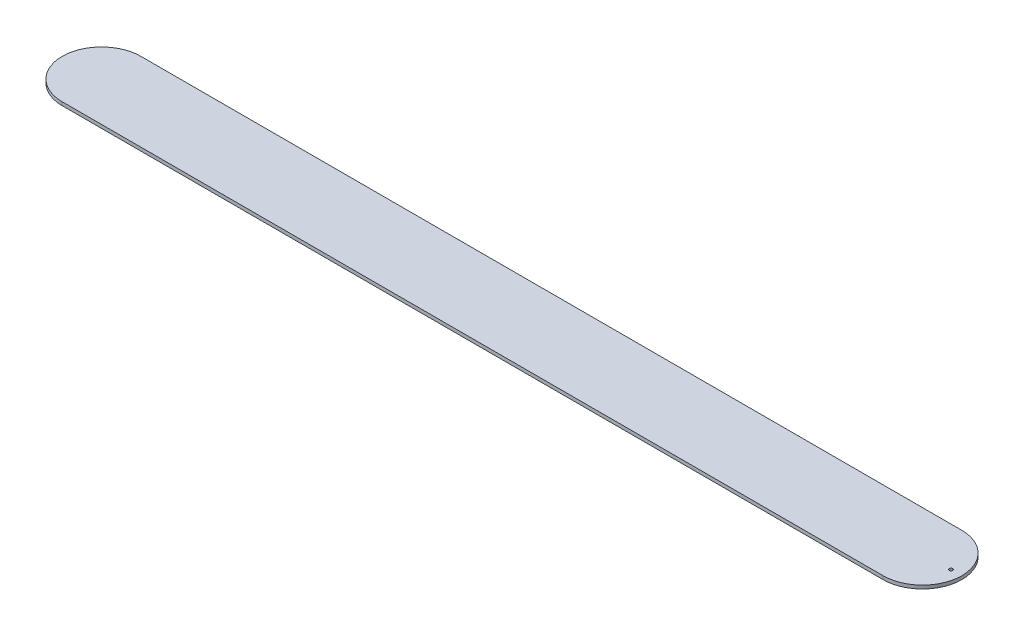
ISO-10303-21;
HEADER;
FILE_DESCRIPTION(('STEP AP214'),'2;1');
FILE_NAME('part.step','',(''),(''),'','','');
FILE_SCHEMA(('AUTOMOTIVE_DESIGN { 1 0 10303 214 1 1 1 1 }'));
ENDSEC;
DATA;
#1=APPLICATION_CONTEXT('core data for automotive mechanical design processes');
#2=APPLICATION_PROTOCOL_DEFINITION('international standard','automotive_design',2000,#1);
#3=PRODUCT_CONTEXT('',#1,'mechanical');
#4=PRODUCT('Part','Part','',(#3));
#5=PRODUCT_RELATED_PRODUCT_CATEGORY('part','',(#4));
#6=PRODUCT_DEFINITION_FORMATION('','',#4);
#7=PRODUCT_DEFINITION_CONTEXT('part definition',#1,'design');
#8=PRODUCT_DEFINITION('design','',#6,#7);
#9=PRODUCT_DEFINITION_SHAPE('','',#8);
#10=(LENGTH_UNIT() NAMED_UNIT(*) SI_UNIT(.MILLI.,.METRE.));
#11=(NAMED_UNIT(*) PLANE_ANGLE_UNIT() SI_UNIT($,.RADIAN.));
#12=(NAMED_UNIT(*) SI_UNIT($,.STERADIAN.) SOLID_ANGLE_UNIT());
#13=UNCERTAINTY_MEASURE_WITH_UNIT(LENGTH_MEASURE(1.E-05),#10,'distance_accuracy_value','');
#14=(GEOMETRIC_REPRESENTATION_CONTEXT(3) GLOBAL_UNCERTAINTY_ASSIGNED_CONTEXT((#13)) GLOBAL_UNIT_ASSIGNED_CONTEXT((#10,
#11,#12)) REPRESENTATION_CONTEXT('',''));
#15=CARTESIAN_POINT('',(0.,0.,0.));
#16=DIRECTION('',(0.,0.,1.));
#17=DIRECTION('',(1.,0.,0.));
#18=AXIS2_PLACEMENT_3D('',#15,#16,#17);
#19=CARTESIAN_POINT('',(360.,3.,5.94002628334644E-06));
#20=DIRECTION('',(0.,-1.,0.));
#21=DIRECTION('',(0.,0.,-1.));
#22=AXIS2_PLACEMENT_3D('',#19,#20,#21);
#23=CYLINDRICAL_SURFACE('',#22,34.4999955449803);
#24=CARTESIAN_POINT('',(360.,0.,5.94002628334644E-06));
#25=DIRECTION('',(0.,1.,0.));
#26=DIRECTION('',(0.,0.,1.));
#27=AXIS2_PLACEMENT_3D('',#24,#25,#26);
#28=CIRCLE('',#27,34.4999955449803);
#29=CARTESIAN_POINT('',(360.,0.,34.5000014850066));
#30=VERTEX_POINT('',#29);
#31=CARTESIAN_POINT('',(360.,0.,-34.499989604954));
#32=VERTEX_POINT('',#31);
#33=EDGE_CURVE('E96',#30,#32,#28,.T.);
#34=ORIENTED_EDGE('',*,*,#33,.T.);
#35=DIRECTION('',(0.,-1.,0.));
#36=VECTOR('',#35,1.);
#37=CARTESIAN_POINT('',(360.,3.,-34.499989604954));
#38=LINE('',#37,#36);
#39=CARTESIAN_POINT('',(360.,3.,-34.499989604954));
#40=VERTEX_POINT('',#39);
#41=EDGE_CURVE('E11',#40,#32,#38,.T.);
#42=ORIENTED_EDGE('',*,*,#41,.F.);
#43=CARTESIAN_POINT('',(360.,3.,5.94002628334644E-06));
#44=DIRECTION('',(0.,1.,0.));
#45=DIRECTION('',(0.,0.,1.));
#46=AXIS2_PLACEMENT_3D('',#43,#44,#45);
#47=CIRCLE('',#46,34.4999955449803);
#48=CARTESIAN_POINT('',(360.,3.,34.5000014850066));
#49=VERTEX_POINT('',#48);
#50=EDGE_CURVE('E84',#49,#40,#47,.T.);
#51=ORIENTED_EDGE('',*,*,#50,.F.);
#52=DIRECTION('',(0.,-1.,0.));
#53=VECTOR('',#52,1.);
#54=CARTESIAN_POINT('',(360.,3.,34.5000014850066));
#55=LINE('',#54,#53);
#56=EDGE_CURVE('E92',#49,#30,#55,.T.);
#57=ORIENTED_EDGE('',*,*,#56,.T.);
#58=EDGE_LOOP('',(#34,#42,#51,#57));
#59=FACE_BOUND('',#58,.T.);
#60=ADVANCED_FACE('F33',(#59),#23,.T.);
#61=CARTESIAN_POINT('',(360.,3.,-34.499989604954));
#62=DIRECTION('',(0.,0.,1.));
#63=DIRECTION('',(1.,0.,0.));
#64=AXIS2_PLACEMENT_3D('',#61,#62,#63);
#65=PLANE('',#64);
#66=DIRECTION('',(-1.,0.,0.));
#67=VECTOR('',#66,1.);
#68=CARTESIAN_POINT('',(360.,0.,-34.499989604954));
#69=LINE('',#68,#67);
#70=CARTESIAN_POINT('',(-360.000000010313,0.,-34.499989604954));
#71=VERTEX_POINT('',#70);
#72=EDGE_CURVE('E88',#32,#71,#69,.T.);
#73=ORIENTED_EDGE('',*,*,#72,.T.);
#74=DIRECTION('',(0.,-1.,0.));
#75=VECTOR('',#74,1.);
#76=CARTESIAN_POINT('',(-360.000000010313,3.,-34.499989604954));
#77=LINE('',#76,#75);
#78=CARTESIAN_POINT('',(-360.000000010313,3.,-34.499989604954));
#79=VERTEX_POINT('',#78);
#80=EDGE_CURVE('E41',#79,#71,#77,.T.);
#81=ORIENTED_EDGE('',*,*,#80,.F.);
#82=DIRECTION('',(-1.,0.,0.));
#83=VECTOR('',#82,1.);
#84=CARTESIAN_POINT('',(360.,3.,-34.499989604954));
#85=LINE('',#84,#83);
#86=EDGE_CURVE('E79',#40,#79,#85,.T.);
#87=ORIENTED_EDGE('',*,*,#86,.F.);
#88=ORIENTED_EDGE('',*,*,#41,.T.);
#89=EDGE_LOOP('',(#73,#81,#87,#88));
#90=FACE_BOUND('',#89,.T.);
#91=ADVANCED_FACE('F87',(#90),#65,.F.);
#92=CARTESIAN_POINT('',(-360.000000010313,3.,5.94002628334644E-06));
#93=DIRECTION('',(0.,-1.,0.));
#94=DIRECTION('',(0.,0.,-1.));
#95=AXIS2_PLACEMENT_3D('',#92,#93,#94);
#96=CYLINDRICAL_SURFACE('',#95,34.4999955449803);
#97=CARTESIAN_POINT('',(-360.000000010313,0.,5.94002628334644E-06));
#98=DIRECTION('',(0.,1.,0.));
#99=DIRECTION('',(0.,0.,1.));
#100=AXIS2_PLACEMENT_3D('',#97,#98,#99);
#101=CIRCLE('',#100,34.4999955449803);
#102=CARTESIAN_POINT('',(-360.000000010313,0.,34.5000014850066));
#103=VERTEX_POINT('',#102);
#104=EDGE_CURVE('E66',#71,#103,#101,.T.);
#105=ORIENTED_EDGE('',*,*,#104,.T.);
#106=DIRECTION('',(0.,-1.,0.));
#107=VECTOR('',#106,1.);
#108=CARTESIAN_POINT('',(-360.000000010313,3.,34.5000014850066));
#109=LINE('',#108,#107);
#110=CARTESIAN_POINT('',(-360.000000010313,3.,34.5000014850066));
#111=VERTEX_POINT('',#110);
#112=EDGE_CURVE('E89',#111,#103,#109,.T.);
#113=ORIENTED_EDGE('',*,*,#112,.F.);
#114=CARTESIAN_POINT('',(-360.000000010313,3.,5.94002628334644E-06));
#115=DIRECTION('',(0.,1.,0.));
#116=DIRECTION('',(0.,0.,1.));
#117=AXIS2_PLACEMENT_3D('',#114,#115,#116);
#118=CIRCLE('',#117,34.4999955449803);
#119=EDGE_CURVE('E82',#79,#111,#118,.T.);
#120=ORIENTED_EDGE('',*,*,#119,.F.);
#121=ORIENTED_EDGE('',*,*,#80,.T.);
#122=EDGE_LOOP('',(#105,#113,#120,#121));
#123=FACE_BOUND('',#122,.T.);
#124=ADVANCED_FACE('F90',(#123),#96,.T.);
#125=CARTESIAN_POINT('',(-360.000000010313,3.,34.5000014850066));
#126=DIRECTION('',(0.,0.,-1.));
#127=DIRECTION('',(-1.,0.,0.));
#128=AXIS2_PLACEMENT_3D('',#125,#126,#127);
#129=PLANE('',#128);
#130=DIRECTION('',(1.,0.,0.));
#131=VECTOR('',#130,1.);
#132=CARTESIAN_POINT('',(-360.000000010313,0.,34.5000014850066));
#133=LINE('',#132,#131);
#134=EDGE_CURVE('E72',#103,#30,#133,.T.);
#135=ORIENTED_EDGE('',*,*,#134,.T.);
#136=ORIENTED_EDGE('',*,*,#56,.F.);
#137=DIRECTION('',(1.,0.,0.));
#138=VECTOR('',#137,1.);
#139=CARTESIAN_POINT('',(-360.000000010313,3.,34.5000014850066));
#140=LINE('',#139,#138);
#141=EDGE_CURVE('E49',#111,#49,#140,.T.);
#142=ORIENTED_EDGE('',*,*,#141,.F.);
#143=ORIENTED_EDGE('',*,*,#112,.T.);
#144=EDGE_LOOP('',(#135,#136,#142,#143));
#145=FACE_BOUND('',#144,.T.);
#146=ADVANCED_FACE('F104',(#145),#129,.F.);
#147=CARTESIAN_POINT('',(360.,3.,5.94002628334644E-06));
#148=DIRECTION('',(0.,1.,0.));
#149=DIRECTION('',(0.,0.,1.));
#150=AXIS2_PLACEMENT_3D('',#147,#148,#149);
#151=PLANE('',#150);
#152=CARTESIAN_POINT('',(385.000000047591,3.,0.));
#153=DIRECTION('',(0.,1.,0.));
#154=DIRECTION('',(0.,0.,1.));
#155=AXIS2_PLACEMENT_3D('',#152,#153,#154);
#156=CIRCLE('',#155,1.5);
#157=CARTESIAN_POINT('',(385.000000047591,3.,1.5));
#158=VERTEX_POINT('',#157);
#159=EDGE_CURVE('E112',#158,#158,#156,.T.);
#160=ORIENTED_EDGE('',*,*,#159,.F.);
#161=EDGE_LOOP('',(#160));
#162=FACE_BOUND('',#161,.T.);
#163=ORIENTED_EDGE('',*,*,#50,.T.);
#164=ORIENTED_EDGE('',*,*,#86,.T.);
#165=ORIENTED_EDGE('',*,*,#119,.T.);
#166=ORIENTED_EDGE('',*,*,#141,.T.);
#167=EDGE_LOOP('',(#163,#164,#165,#166));
#168=FACE_BOUND('',#167,.T.);
#169=ADVANCED_FACE('F80',(#162,#168),#151,.T.);
#170=CARTESIAN_POINT('',(360.,0.,5.94002628334644E-06));
#171=DIRECTION('',(0.,1.,0.));
#172=DIRECTION('',(0.,0.,1.));
#173=AXIS2_PLACEMENT_3D('',#170,#171,#172);
#174=PLANE('',#173);
#175=CARTESIAN_POINT('',(385.000000047591,0.,0.));
#176=DIRECTION('',(0.,1.,0.));
#177=DIRECTION('',(0.,0.,1.));
#178=AXIS2_PLACEMENT_3D('',#175,#176,#177);
#179=CIRCLE('',#178,1.5);
#180=CARTESIAN_POINT('',(385.000000047591,0.,1.5));
#181=VERTEX_POINT('',#180);
#182=EDGE_CURVE('E99',#181,#181,#179,.T.);
#183=ORIENTED_EDGE('',*,*,#182,.T.);
#184=EDGE_LOOP('',(#183));
#185=FACE_BOUND('',#184,.T.);
#186=ORIENTED_EDGE('',*,*,#33,.F.);
#187=ORIENTED_EDGE('',*,*,#134,.F.);
#188=ORIENTED_EDGE('',*,*,#104,.F.);
#189=ORIENTED_EDGE('',*,*,#72,.F.);
#190=EDGE_LOOP('',(#186,#187,#188,#189));
#191=FACE_BOUND('',#190,.T.);
#192=ADVANCED_FACE('F107',(#185,#191),#174,.F.);
#193=CARTESIAN_POINT('',(385.000000047591,3.,0.));
#194=DIRECTION('',(0.,1.,0.));
#195=DIRECTION('',(0.,0.,1.));
#196=AXIS2_PLACEMENT_3D('',#193,#194,#195);
#197=CYLINDRICAL_SURFACE('',#196,1.5);
#198=ORIENTED_EDGE('',*,*,#182,.F.);
#199=EDGE_LOOP('',(#198));
#200=FACE_BOUND('',#199,.T.);
#201=ORIENTED_EDGE('',*,*,#159,.T.);
#202=EDGE_LOOP('',(#201));
#203=FACE_BOUND('',#202,.T.);
#204=ADVANCED_FACE('F116',(#200,#203),#197,.F.);
#205=CLOSED_SHELL('',(#60,#91,#124,#146,#169,#192,#204));
#206=MANIFOLD_SOLID_BREP('B2',#205);
#207=ADVANCED_BREP_SHAPE_REPRESENTATION('',(#18,#206),#14);
#208=SHAPE_DEFINITION_REPRESENTATION(#9,#207);
ENDSEC;
END-ISO-10303-21;
